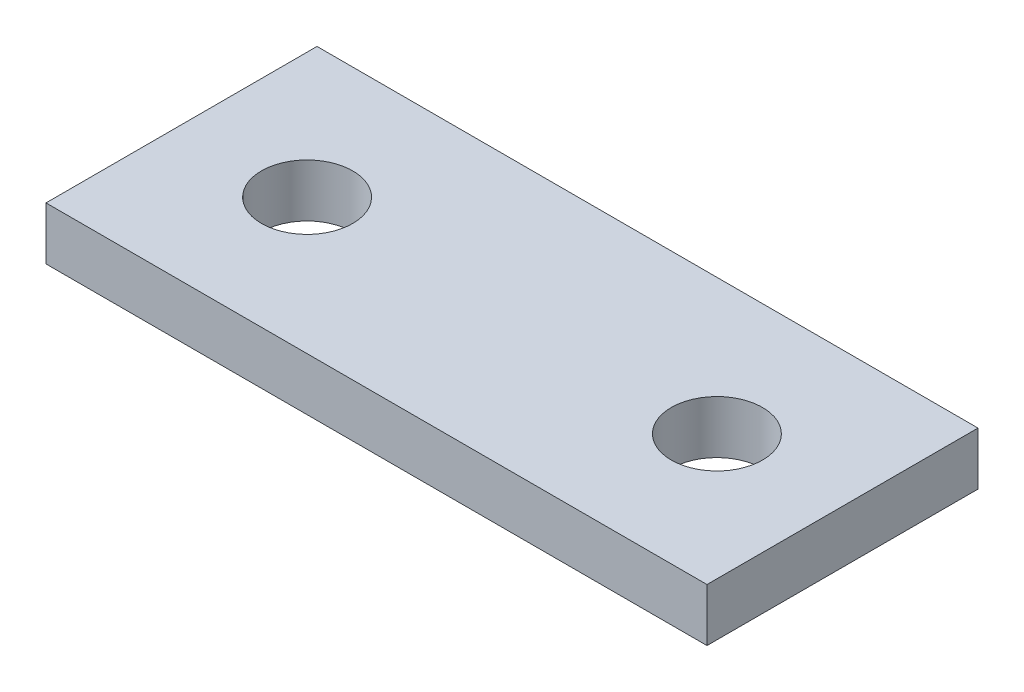
ISO-10303-21;
HEADER;
FILE_DESCRIPTION(('STEP AP214'),'2;1');
FILE_NAME('part.step','',(''),(''),'','','');
FILE_SCHEMA(('AUTOMOTIVE_DESIGN { 1 0 10303 214 1 1 1 1 }'));
ENDSEC;
DATA;
#1=APPLICATION_CONTEXT('core data for automotive mechanical design processes');
#2=APPLICATION_PROTOCOL_DEFINITION('international standard','automotive_design',2000,#1);
#3=PRODUCT_CONTEXT('',#1,'mechanical');
#4=PRODUCT('Part','Part','',(#3));
#5=PRODUCT_RELATED_PRODUCT_CATEGORY('part','',(#4));
#6=PRODUCT_DEFINITION_FORMATION('','',#4);
#7=PRODUCT_DEFINITION_CONTEXT('part definition',#1,'design');
#8=PRODUCT_DEFINITION('design','',#6,#7);
#9=PRODUCT_DEFINITION_SHAPE('','',#8);
#10=(LENGTH_UNIT() NAMED_UNIT(*) SI_UNIT(.MILLI.,.METRE.));
#11=(NAMED_UNIT(*) PLANE_ANGLE_UNIT() SI_UNIT($,.RADIAN.));
#12=(NAMED_UNIT(*) SI_UNIT($,.STERADIAN.) SOLID_ANGLE_UNIT());
#13=UNCERTAINTY_MEASURE_WITH_UNIT(LENGTH_MEASURE(1.E-05),#10,'distance_accuracy_value','');
#14=(GEOMETRIC_REPRESENTATION_CONTEXT(3) GLOBAL_UNCERTAINTY_ASSIGNED_CONTEXT((#13)) GLOBAL_UNIT_ASSIGNED_CONTEXT((#10,
#11,#12)) REPRESENTATION_CONTEXT('',''));
#15=CARTESIAN_POINT('',(0.,0.,0.));
#16=DIRECTION('',(0.,0.,1.));
#17=DIRECTION('',(1.,0.,0.));
#18=AXIS2_PLACEMENT_3D('',#15,#16,#17);
#19=CARTESIAN_POINT('',(0.,2.032,0.));
#20=DIRECTION('',(0.,1.,0.));
#21=DIRECTION('',(0.,0.,1.));
#22=AXIS2_PLACEMENT_3D('',#19,#20,#21);
#23=PLANE('',#22);
#24=CARTESIAN_POINT('',(-6.8244132231405,2.032,2.67802066115703));
#25=DIRECTION('',(0.,1.,0.));
#26=DIRECTION('',(0.,0.,1.));
#27=AXIS2_PLACEMENT_3D('',#24,#25,#26);
#28=CIRCLE('',#27,1.7526);
#29=CARTESIAN_POINT('',(-6.8244132231405,2.032,4.43062066115703));
#30=VERTEX_POINT('',#29);
#31=EDGE_CURVE('E104',#30,#30,#28,.T.);
#32=ORIENTED_EDGE('',*,*,#31,.F.);
#33=EDGE_LOOP('',(#32));
#34=FACE_BOUND('',#33,.T.);
#35=DIRECTION('',(0.,0.,1.));
#36=VECTOR('',#35,1.);
#37=CARTESIAN_POINT('',(-11.6504132231405,2.032,-2.52897933884297));
#38=LINE('',#37,#36);
#39=CARTESIAN_POINT('',(-11.6504132231405,2.032,-2.52897933884297));
#40=VERTEX_POINT('',#39);
#41=CARTESIAN_POINT('',(-11.6504132231405,2.032,7.88502066115703));
#42=VERTEX_POINT('',#41);
#43=EDGE_CURVE('E89',#40,#42,#38,.T.);
#44=ORIENTED_EDGE('',*,*,#43,.T.);
#45=DIRECTION('',(1.,0.,0.));
#46=VECTOR('',#45,1.);
#47=CARTESIAN_POINT('',(-11.6504132231405,2.032,7.88502066115703));
#48=LINE('',#47,#46);
#49=CARTESIAN_POINT('',(13.7495867768595,2.032,7.88502066115703));
#50=VERTEX_POINT('',#49);
#51=EDGE_CURVE('E84',#42,#50,#48,.T.);
#52=ORIENTED_EDGE('',*,*,#51,.T.);
#53=DIRECTION('',(0.,0.,-1.));
#54=VECTOR('',#53,1.);
#55=CARTESIAN_POINT('',(13.7495867768595,2.032,-2.52897933884297));
#56=LINE('',#55,#54);
#57=CARTESIAN_POINT('',(13.7495867768595,2.032,-2.52897933884297));
#58=VERTEX_POINT('',#57);
#59=EDGE_CURVE('E87',#50,#58,#56,.T.);
#60=ORIENTED_EDGE('',*,*,#59,.T.);
#61=DIRECTION('',(-1.,0.,0.));
#62=VECTOR('',#61,1.);
#63=CARTESIAN_POINT('',(-11.6504132231405,2.032,-2.52897933884297));
#64=LINE('',#63,#62);
#65=EDGE_CURVE('E54',#58,#40,#64,.T.);
#66=ORIENTED_EDGE('',*,*,#65,.T.);
#67=EDGE_LOOP('',(#44,#52,#60,#66));
#68=FACE_BOUND('',#67,.T.);
#69=CARTESIAN_POINT('',(8.9235867768595,2.032,2.67802066115703));
#70=DIRECTION('',(0.,1.,0.));
#71=DIRECTION('',(0.,0.,1.));
#72=AXIS2_PLACEMENT_3D('',#69,#70,#71);
#73=CIRCLE('',#72,1.7526);
#74=CARTESIAN_POINT('',(8.9235867768595,2.032,4.43062066115703));
#75=VERTEX_POINT('',#74);
#76=EDGE_CURVE('E119',#75,#75,#73,.T.);
#77=ORIENTED_EDGE('',*,*,#76,.F.);
#78=EDGE_LOOP('',(#77));
#79=FACE_BOUND('',#78,.T.);
#80=ADVANCED_FACE('F37',(#34,#68,#79),#23,.T.);
#81=CARTESIAN_POINT('',(0.,0.,0.));
#82=DIRECTION('',(0.,1.,0.));
#83=DIRECTION('',(0.,0.,1.));
#84=AXIS2_PLACEMENT_3D('',#81,#82,#83);
#85=PLANE('',#84);
#86=DIRECTION('',(0.,0.,1.));
#87=VECTOR('',#86,1.);
#88=CARTESIAN_POINT('',(-11.6504132231405,0.,-2.52897933884297));
#89=LINE('',#88,#87);
#90=CARTESIAN_POINT('',(-11.6504132231405,0.,-2.52897933884297));
#91=VERTEX_POINT('',#90);
#92=CARTESIAN_POINT('',(-11.6504132231405,0.,7.88502066115703));
#93=VERTEX_POINT('',#92);
#94=EDGE_CURVE('E101',#91,#93,#89,.T.);
#95=ORIENTED_EDGE('',*,*,#94,.F.);
#96=DIRECTION('',(-1.,0.,0.));
#97=VECTOR('',#96,1.);
#98=CARTESIAN_POINT('',(-11.6504132231405,0.,-2.52897933884297));
#99=LINE('',#98,#97);
#100=CARTESIAN_POINT('',(13.7495867768595,0.,-2.52897933884297));
#101=VERTEX_POINT('',#100);
#102=EDGE_CURVE('E77',#101,#91,#99,.T.);
#103=ORIENTED_EDGE('',*,*,#102,.F.);
#104=DIRECTION('',(0.,0.,-1.));
#105=VECTOR('',#104,1.);
#106=CARTESIAN_POINT('',(13.7495867768595,0.,-2.52897933884297));
#107=LINE('',#106,#105);
#108=CARTESIAN_POINT('',(13.7495867768595,0.,7.88502066115703));
#109=VERTEX_POINT('',#108);
#110=EDGE_CURVE('E71',#109,#101,#107,.T.);
#111=ORIENTED_EDGE('',*,*,#110,.F.);
#112=DIRECTION('',(1.,0.,0.));
#113=VECTOR('',#112,1.);
#114=CARTESIAN_POINT('',(-11.6504132231405,0.,7.88502066115703));
#115=LINE('',#114,#113);
#116=EDGE_CURVE('E93',#93,#109,#115,.T.);
#117=ORIENTED_EDGE('',*,*,#116,.F.);
#118=EDGE_LOOP('',(#95,#103,#111,#117));
#119=FACE_BOUND('',#118,.T.);
#120=CARTESIAN_POINT('',(-6.8244132231405,0.,2.67802066115703));
#121=DIRECTION('',(0.,1.,0.));
#122=DIRECTION('',(0.,0.,1.));
#123=AXIS2_PLACEMENT_3D('',#120,#121,#122);
#124=CIRCLE('',#123,1.7526);
#125=CARTESIAN_POINT('',(-6.8244132231405,0.,4.43062066115703));
#126=VERTEX_POINT('',#125);
#127=EDGE_CURVE('E116',#126,#126,#124,.T.);
#128=ORIENTED_EDGE('',*,*,#127,.T.);
#129=EDGE_LOOP('',(#128));
#130=FACE_BOUND('',#129,.T.);
#131=CARTESIAN_POINT('',(8.9235867768595,0.,2.67802066115703));
#132=DIRECTION('',(0.,1.,0.));
#133=DIRECTION('',(0.,0.,1.));
#134=AXIS2_PLACEMENT_3D('',#131,#132,#133);
#135=CIRCLE('',#134,1.7526);
#136=CARTESIAN_POINT('',(8.9235867768595,0.,4.43062066115703));
#137=VERTEX_POINT('',#136);
#138=EDGE_CURVE('E122',#137,#137,#135,.T.);
#139=ORIENTED_EDGE('',*,*,#138,.T.);
#140=EDGE_LOOP('',(#139));
#141=FACE_BOUND('',#140,.T.);
#142=ADVANCED_FACE('F112',(#119,#130,#141),#85,.F.);
#143=CARTESIAN_POINT('',(-11.6504132231405,2.032,-2.52897933884297));
#144=DIRECTION('',(1.,0.,0.));
#145=DIRECTION('',(0.,0.,-1.));
#146=AXIS2_PLACEMENT_3D('',#143,#144,#145);
#147=PLANE('',#146);
#148=ORIENTED_EDGE('',*,*,#94,.T.);
#149=DIRECTION('',(0.,-1.,0.));
#150=VECTOR('',#149,1.);
#151=CARTESIAN_POINT('',(-11.6504132231405,2.032,7.88502066115703));
#152=LINE('',#151,#150);
#153=EDGE_CURVE('E11',#42,#93,#152,.T.);
#154=ORIENTED_EDGE('',*,*,#153,.F.);
#155=ORIENTED_EDGE('',*,*,#43,.F.);
#156=DIRECTION('',(0.,-1.,0.));
#157=VECTOR('',#156,1.);
#158=CARTESIAN_POINT('',(-11.6504132231405,2.032,-2.52897933884297));
#159=LINE('',#158,#157);
#160=EDGE_CURVE('E97',#40,#91,#159,.T.);
#161=ORIENTED_EDGE('',*,*,#160,.T.);
#162=EDGE_LOOP('',(#148,#154,#155,#161));
#163=FACE_BOUND('',#162,.T.);
#164=ADVANCED_FACE('F39',(#163),#147,.F.);
#165=CARTESIAN_POINT('',(-11.6504132231405,2.032,7.88502066115703));
#166=DIRECTION('',(0.,0.,-1.));
#167=DIRECTION('',(-1.,0.,0.));
#168=AXIS2_PLACEMENT_3D('',#165,#166,#167);
#169=PLANE('',#168);
#170=ORIENTED_EDGE('',*,*,#116,.T.);
#171=DIRECTION('',(0.,-1.,0.));
#172=VECTOR('',#171,1.);
#173=CARTESIAN_POINT('',(13.7495867768595,2.032,7.88502066115703));
#174=LINE('',#173,#172);
#175=EDGE_CURVE('E46',#50,#109,#174,.T.);
#176=ORIENTED_EDGE('',*,*,#175,.F.);
#177=ORIENTED_EDGE('',*,*,#51,.F.);
#178=ORIENTED_EDGE('',*,*,#153,.T.);
#179=EDGE_LOOP('',(#170,#176,#177,#178));
#180=FACE_BOUND('',#179,.T.);
#181=ADVANCED_FACE('F92',(#180),#169,.F.);
#182=CARTESIAN_POINT('',(13.7495867768595,2.032,-2.52897933884297));
#183=DIRECTION('',(-1.,0.,0.));
#184=DIRECTION('',(0.,0.,1.));
#185=AXIS2_PLACEMENT_3D('',#182,#183,#184);
#186=PLANE('',#185);
#187=ORIENTED_EDGE('',*,*,#110,.T.);
#188=DIRECTION('',(0.,-1.,0.));
#189=VECTOR('',#188,1.);
#190=CARTESIAN_POINT('',(13.7495867768595,2.032,-2.52897933884297));
#191=LINE('',#190,#189);
#192=EDGE_CURVE('E94',#58,#101,#191,.T.);
#193=ORIENTED_EDGE('',*,*,#192,.F.);
#194=ORIENTED_EDGE('',*,*,#59,.F.);
#195=ORIENTED_EDGE('',*,*,#175,.T.);
#196=EDGE_LOOP('',(#187,#193,#194,#195));
#197=FACE_BOUND('',#196,.T.);
#198=ADVANCED_FACE('F95',(#197),#186,.F.);
#199=CARTESIAN_POINT('',(-11.6504132231405,2.032,-2.52897933884297));
#200=DIRECTION('',(0.,0.,1.));
#201=DIRECTION('',(1.,0.,0.));
#202=AXIS2_PLACEMENT_3D('',#199,#200,#201);
#203=PLANE('',#202);
#204=ORIENTED_EDGE('',*,*,#102,.T.);
#205=ORIENTED_EDGE('',*,*,#160,.F.);
#206=ORIENTED_EDGE('',*,*,#65,.F.);
#207=ORIENTED_EDGE('',*,*,#192,.T.);
#208=EDGE_LOOP('',(#204,#205,#206,#207));
#209=FACE_BOUND('',#208,.T.);
#210=ADVANCED_FACE('F109',(#209),#203,.F.);
#211=CARTESIAN_POINT('',(-6.8244132231405,2.032,2.67802066115703));
#212=DIRECTION('',(0.,-1.,0.));
#213=DIRECTION('',(0.,0.,-1.));
#214=AXIS2_PLACEMENT_3D('',#211,#212,#213);
#215=CYLINDRICAL_SURFACE('',#214,1.7526);
#216=ORIENTED_EDGE('',*,*,#31,.T.);
#217=EDGE_LOOP('',(#216));
#218=FACE_BOUND('',#217,.T.);
#219=ORIENTED_EDGE('',*,*,#127,.F.);
#220=EDGE_LOOP('',(#219));
#221=FACE_BOUND('',#220,.T.);
#222=ADVANCED_FACE('F139',(#218,#221),#215,.F.);
#223=CARTESIAN_POINT('',(8.9235867768595,2.032,2.67802066115703));
#224=DIRECTION('',(0.,-1.,0.));
#225=DIRECTION('',(0.,0.,-1.));
#226=AXIS2_PLACEMENT_3D('',#223,#224,#225);
#227=CYLINDRICAL_SURFACE('',#226,1.7526);
#228=ORIENTED_EDGE('',*,*,#76,.T.);
#229=EDGE_LOOP('',(#228));
#230=FACE_BOUND('',#229,.T.);
#231=ORIENTED_EDGE('',*,*,#138,.F.);
#232=EDGE_LOOP('',(#231));
#233=FACE_BOUND('',#232,.T.);
#234=ADVANCED_FACE('F128',(#230,#233),#227,.F.);
#235=CLOSED_SHELL('',(#80,#142,#164,#181,#198,#210,#222,#234));
#236=MANIFOLD_SOLID_BREP('B2',#235);
#237=ADVANCED_BREP_SHAPE_REPRESENTATION('',(#18,#236),#14);
#238=SHAPE_DEFINITION_REPRESENTATION(#9,#237);
ENDSEC;
END-ISO-10303-21;
